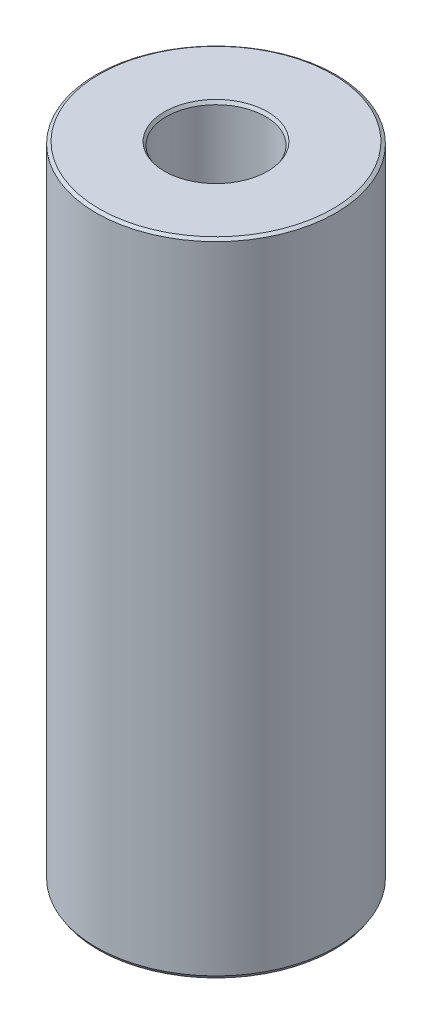
ISO-10303-21;
HEADER;
FILE_DESCRIPTION(('STEP AP214'),'2;1');
FILE_NAME('part.step','',(''),(''),'','','');
FILE_SCHEMA(('AUTOMOTIVE_DESIGN { 1 0 10303 214 1 1 1 1 }'));
ENDSEC;
DATA;
#1=APPLICATION_CONTEXT('core data for automotive mechanical design processes');
#2=APPLICATION_PROTOCOL_DEFINITION('international standard','automotive_design',2000,#1);
#3=PRODUCT_CONTEXT('',#1,'mechanical');
#4=PRODUCT('Part','Part','',(#3));
#5=PRODUCT_RELATED_PRODUCT_CATEGORY('part','',(#4));
#6=PRODUCT_DEFINITION_FORMATION('','',#4);
#7=PRODUCT_DEFINITION_CONTEXT('part definition',#1,'design');
#8=PRODUCT_DEFINITION('design','',#6,#7);
#9=PRODUCT_DEFINITION_SHAPE('','',#8);
#10=(LENGTH_UNIT() NAMED_UNIT(*) SI_UNIT(.MILLI.,.METRE.));
#11=(NAMED_UNIT(*) PLANE_ANGLE_UNIT() SI_UNIT($,.RADIAN.));
#12=(NAMED_UNIT(*) SI_UNIT($,.STERADIAN.) SOLID_ANGLE_UNIT());
#13=UNCERTAINTY_MEASURE_WITH_UNIT(LENGTH_MEASURE(1.E-05),#10,'distance_accuracy_value','');
#14=(GEOMETRIC_REPRESENTATION_CONTEXT(3) GLOBAL_UNCERTAINTY_ASSIGNED_CONTEXT((#13)) GLOBAL_UNIT_ASSIGNED_CONTEXT((#10,
#11,#12)) REPRESENTATION_CONTEXT('',''));
#15=CARTESIAN_POINT('',(0.,0.,0.));
#16=DIRECTION('',(0.,0.,1.));
#17=DIRECTION('',(1.,0.,0.));
#18=AXIS2_PLACEMENT_3D('',#15,#16,#17);
#19=CARTESIAN_POINT('',(0.,133.760016249652,0.));
#20=DIRECTION('',(0.,-1.,0.));
#21=DIRECTION('',(0.,0.,-1.));
#22=AXIS2_PLACEMENT_3D('',#19,#20,#21);
#23=CYLINDRICAL_SURFACE('',#22,25.);
#24=CARTESIAN_POINT('',(0.,0.658825721858519,0.));
#25=DIRECTION('',(0.,1.,0.));
#26=DIRECTION('',(0.,0.,1.));
#27=AXIS2_PLACEMENT_3D('',#24,#25,#26);
#28=CIRCLE('',#27,25.);
#29=CARTESIAN_POINT('',(0.,0.658825721858519,25.));
#30=VERTEX_POINT('',#29);
#31=EDGE_CURVE('E10',#30,#30,#28,.T.);
#32=ORIENTED_EDGE('',*,*,#31,.T.);
#33=EDGE_LOOP('',(#32));
#34=FACE_BOUND('',#33,.T.);
#35=CARTESIAN_POINT('',(0.,133.341393853596,0.));
#36=DIRECTION('',(0.,1.,0.));
#37=DIRECTION('',(0.,0.,1.));
#38=AXIS2_PLACEMENT_3D('',#35,#36,#37);
#39=CIRCLE('',#38,25.);
#40=CARTESIAN_POINT('',(0.,133.341393853596,25.));
#41=VERTEX_POINT('',#40);
#42=EDGE_CURVE('E50',#41,#41,#39,.F.);
#43=ORIENTED_EDGE('',*,*,#42,.T.);
#44=EDGE_LOOP('',(#43));
#45=FACE_BOUND('',#44,.T.);
#46=ADVANCED_FACE('F39',(#34,#45),#23,.T.);
#47=CARTESIAN_POINT('',(0.,133.760016249652,0.));
#48=DIRECTION('',(0.,1.,0.));
#49=DIRECTION('',(0.,0.,1.));
#50=AXIS2_PLACEMENT_3D('',#47,#48,#49);
#51=PLANE('',#50);
#52=CARTESIAN_POINT('',(0.,133.760016249652,0.));
#53=DIRECTION('',(0.,1.,0.));
#54=DIRECTION('',(0.,0.,1.));
#55=AXIS2_PLACEMENT_3D('',#52,#53,#54);
#56=CIRCLE('',#55,10.7630156165649);
#57=CARTESIAN_POINT('',(0.,133.760016249652,10.7630156165649));
#58=VERTEX_POINT('',#57);
#59=EDGE_CURVE('E58',#58,#58,#56,.F.);
#60=ORIENTED_EDGE('',*,*,#59,.T.);
#61=EDGE_LOOP('',(#60));
#62=FACE_BOUND('',#61,.T.);
#63=CARTESIAN_POINT('',(0.,133.760016249652,0.));
#64=DIRECTION('',(0.,1.,0.));
#65=DIRECTION('',(0.,0.,1.));
#66=AXIS2_PLACEMENT_3D('',#63,#64,#65);
#67=CIRCLE('',#66,24.3411742781414);
#68=CARTESIAN_POINT('',(0.,133.760016249652,24.3411742781414));
#69=VERTEX_POINT('',#68);
#70=EDGE_CURVE('E61',#69,#69,#67,.T.);
#71=ORIENTED_EDGE('',*,*,#70,.T.);
#72=EDGE_LOOP('',(#71));
#73=FACE_BOUND('',#72,.T.);
#74=ADVANCED_FACE('F88',(#62,#73),#51,.T.);
#75=CARTESIAN_POINT('',(0.,0.,0.));
#76=DIRECTION('',(0.,1.,0.));
#77=DIRECTION('',(0.,0.,1.));
#78=AXIS2_PLACEMENT_3D('',#75,#76,#77);
#79=PLANE('',#78);
#80=CARTESIAN_POINT('',(0.,0.,0.));
#81=DIRECTION('',(0.,1.,0.));
#82=DIRECTION('',(0.,0.,1.));
#83=AXIS2_PLACEMENT_3D('',#80,#81,#82);
#84=CIRCLE('',#83,11.0032189423683);
#85=CARTESIAN_POINT('',(0.,0.,11.0032189423683));
#86=VERTEX_POINT('',#85);
#87=EDGE_CURVE('E51',#86,#86,#84,.T.);
#88=ORIENTED_EDGE('',*,*,#87,.T.);
#89=EDGE_LOOP('',(#88));
#90=FACE_BOUND('',#89,.T.);
#91=CARTESIAN_POINT('',(0.,0.,0.));
#92=DIRECTION('',(0.,1.,0.));
#93=DIRECTION('',(0.,0.,1.));
#94=AXIS2_PLACEMENT_3D('',#91,#92,#93);
#95=CIRCLE('',#94,24.5813776039448);
#96=CARTESIAN_POINT('',(0.,0.,24.5813776039448));
#97=VERTEX_POINT('',#96);
#98=EDGE_CURVE('E54',#97,#97,#95,.F.);
#99=ORIENTED_EDGE('',*,*,#98,.T.);
#100=EDGE_LOOP('',(#99));
#101=FACE_BOUND('',#100,.T.);
#102=ADVANCED_FACE('F83',(#90,#101),#79,.F.);
#103=CARTESIAN_POINT('',(0.,133.760016249652,0.));
#104=DIRECTION('',(0.,-1.,0.));
#105=DIRECTION('',(0.,0.,-1.));
#106=AXIS2_PLACEMENT_3D('',#103,#104,#105);
#107=CYLINDRICAL_SURFACE('',#106,10.3443932205096);
#108=CARTESIAN_POINT('',(0.,133.101190527793,0.));
#109=DIRECTION('',(0.,1.,0.));
#110=DIRECTION('',(0.,0.,1.));
#111=AXIS2_PLACEMENT_3D('',#108,#109,#110);
#112=CIRCLE('',#111,10.3443932205096);
#113=CARTESIAN_POINT('',(0.,133.101190527793,10.3443932205096));
#114=VERTEX_POINT('',#113);
#115=EDGE_CURVE('E67',#114,#114,#112,.T.);
#116=ORIENTED_EDGE('',*,*,#115,.T.);
#117=EDGE_LOOP('',(#116));
#118=FACE_BOUND('',#117,.T.);
#119=CARTESIAN_POINT('',(0.,0.418622396055307,0.));
#120=DIRECTION('',(0.,1.,0.));
#121=DIRECTION('',(0.,0.,1.));
#122=AXIS2_PLACEMENT_3D('',#119,#120,#121);
#123=CIRCLE('',#122,10.3443932205096);
#124=CARTESIAN_POINT('',(0.,0.418622396055307,10.3443932205096));
#125=VERTEX_POINT('',#124);
#126=EDGE_CURVE('E69',#125,#125,#123,.F.);
#127=ORIENTED_EDGE('',*,*,#126,.T.);
#128=EDGE_LOOP('',(#127));
#129=FACE_BOUND('',#128,.T.);
#130=ADVANCED_FACE('F71',(#118,#129),#107,.F.);
#131=CARTESIAN_POINT('',(0.,133.101190527793,0.));
#132=DIRECTION('',(0.,1.,0.));
#133=DIRECTION('',(0.,0.,1.));
#134=AXIS2_PLACEMENT_3D('',#131,#132,#133);
#135=CONICAL_SURFACE('',#134,10.3443932205096,0.566047936619375);
#136=CARTESIAN_POINT('',(0.,133.760016249652,10.7630156165649));
#137=CARTESIAN_POINT('',(0.,133.753153481716,10.758654966606));
#138=CARTESIAN_POINT('',(0.,133.74629071378,10.7542943166471));
#139=CARTESIAN_POINT('',(0.,133.732565177907,10.7455730167293));
#140=CARTESIAN_POINT('',(0.,133.725702409971,10.7412123667703));
#141=CARTESIAN_POINT('',(0.,133.711976874099,10.7324910668525));
#142=CARTESIAN_POINT('',(0.,133.705114106163,10.7281304168936));
#143=CARTESIAN_POINT('',(0.,133.691388570291,10.7194091169758));
#144=CARTESIAN_POINT('',(0.,133.684525802355,10.7150484670169));
#145=CARTESIAN_POINT('',(0.,133.670800266483,10.7063271670991));
#146=CARTESIAN_POINT('',(0.,133.663937498547,10.7019665171402));
#147=CARTESIAN_POINT('',(0.,133.650211962675,10.6932452172223));
#148=CARTESIAN_POINT('',(0.,133.643349194739,10.6888845672634));
#149=CARTESIAN_POINT('',(0.,133.629623658867,10.6801632673456));
#150=CARTESIAN_POINT('',(0.,133.622760890931,10.6758026173867));
#151=CARTESIAN_POINT('',(0.,133.609035355059,10.6670813174689));
#152=CARTESIAN_POINT('',(0.,133.602172587123,10.66272066751));
#153=CARTESIAN_POINT('',(0.,133.588447051251,10.6539993675922));
#154=CARTESIAN_POINT('',(0.,133.581584283315,10.6496387176333));
#155=CARTESIAN_POINT('',(0.,133.567858747443,10.6409174177154));
#156=CARTESIAN_POINT('',(0.,133.560995979507,10.6365567677565));
#157=CARTESIAN_POINT('',(0.,133.547270443635,10.6278354678387));
#158=CARTESIAN_POINT('',(0.,133.540407675699,10.6234748178798));
#159=CARTESIAN_POINT('',(0.,133.526682139827,10.614753517962));
#160=CARTESIAN_POINT('',(0.,133.519819371891,10.6103928680031));
#161=CARTESIAN_POINT('',(0.,133.506093836019,10.6016715680853));
#162=CARTESIAN_POINT('',(0.,133.499231068083,10.5973109181264));
#163=CARTESIAN_POINT('',(0.,133.485505532211,10.5885896182085));
#164=CARTESIAN_POINT('',(0.,133.478642764274,10.5842289682496));
#165=CARTESIAN_POINT('',(0.,133.464917228402,10.5755076683318));
#166=CARTESIAN_POINT('',(0.,133.458054460466,10.5711470183729));
#167=CARTESIAN_POINT('',(0.,133.444328924594,10.5624257184551));
#168=CARTESIAN_POINT('',(0.,133.437466156658,10.5580650684962));
#169=CARTESIAN_POINT('',(0.,133.423740620786,10.5493437685784));
#170=CARTESIAN_POINT('',(0.,133.41687785285,10.5449831186194));
#171=CARTESIAN_POINT('',(0.,133.403152316978,10.5362618187016));
#172=CARTESIAN_POINT('',(0.,133.396289549042,10.5319011687427));
#173=CARTESIAN_POINT('',(0.,133.38256401317,10.5231798688249));
#174=CARTESIAN_POINT('',(0.,133.375701245234,10.518819218866));
#175=CARTESIAN_POINT('',(0.,133.361975709362,10.5100979189482));
#176=CARTESIAN_POINT('',(0.,133.355112941426,10.5057372689893));
#177=CARTESIAN_POINT('',(0.,133.341387405554,10.4970159690714));
#178=CARTESIAN_POINT('',(0.,133.334524637618,10.4926553191125));
#179=CARTESIAN_POINT('',(0.,133.320799101746,10.4839340191947));
#180=CARTESIAN_POINT('',(0.,133.31393633381,10.4795733692358));
#181=CARTESIAN_POINT('',(0.,133.300210797938,10.470852069318));
#182=CARTESIAN_POINT('',(0.,133.293348030002,10.4664914193591));
#183=CARTESIAN_POINT('',(0.,133.27962249413,10.4577701194413));
#184=CARTESIAN_POINT('',(0.,133.272759726194,10.4534094694824));
#185=CARTESIAN_POINT('',(0.,133.259034190322,10.4446881695645));
#186=CARTESIAN_POINT('',(0.,133.252171422386,10.4403275196056));
#187=CARTESIAN_POINT('',(0.,133.238445886514,10.4316062196878));
#188=CARTESIAN_POINT('',(0.,133.231583118578,10.4272455697289));
#189=CARTESIAN_POINT('',(0.,133.217857582705,10.4185242698111));
#190=CARTESIAN_POINT('',(0.,133.210994814769,10.4141636198522));
#191=CARTESIAN_POINT('',(0.,133.197269278897,10.4054423199344));
#192=CARTESIAN_POINT('',(0.,133.190406510961,10.4010816699755));
#193=CARTESIAN_POINT('',(0.,133.176680975089,10.3923603700576));
#194=CARTESIAN_POINT('',(0.,133.169818207153,10.3879997200987));
#195=CARTESIAN_POINT('',(0.,133.156092671281,10.3792784201809));
#196=CARTESIAN_POINT('',(0.,133.149229903345,10.374917770222));
#197=CARTESIAN_POINT('',(0.,133.135504367473,10.3661964703042));
#198=CARTESIAN_POINT('',(0.,133.128641599537,10.3618358203453));
#199=CARTESIAN_POINT('',(0.,133.114916063665,10.3531145204275));
#200=CARTESIAN_POINT('',(0.,133.108053295729,10.3487538704685));
#201=CARTESIAN_POINT('',(0.,133.101190527793,10.3443932205096));
#202=B_SPLINE_CURVE_WITH_KNOTS('',3,(#136,#137,#138,#139,#140,#141,#142,#143,#144,#145,#146,
#147,#148,#149,#150,#151,#152,#153,#154,#155,#156,#157,#158,#159,#160,#161,#162,#163,#164,#165,
#166,#167,#168,#169,#170,#171,#172,#173,#174,#175,#176,#177,#178,#179,#180,#181,#182,#183,#184,
#185,#186,#187,#188,#189,#190,#191,#192,#193,#194,#195,#196,#197,#198,#199,#200,#201),
.UNSPECIFIED.,.F.,.F.,(4,2,2,2,2,2,2,2,2,2,2,2,2,2,2,2,2,2,2,2,2,2,2,2,2,2,2,2,2,2,2,2,4),(0.,
0.0243929429604561,0.0487858859208879,0.0731788288813206,0.0975717718417524,0.121964714802185,
0.146357657762617,0.17075060072305,0.195143543683481,0.219536486643914,0.243929429604346,
0.268322372564778,0.29271531552521,0.317108258485643,0.341501201446075,0.365894144406507,
0.39028708736694,0.414680030327395,0.439072973287828,0.46346591624826,0.487858859208692,
0.512251802169124,0.536644745129557,0.561037688089989,0.585430631050421,0.609823574010853,
0.634216516971286,0.658609459931718,0.68300240289215,0.707395345852582,0.731788288813015,
0.756181231773447,0.780574174733879),.UNSPECIFIED.);
#203=EDGE_CURVE('BSEAM77',#58,#114,#202,.T.);
#204=ORIENTED_EDGE('',*,*,#59,.F.);
#205=ORIENTED_EDGE('',*,*,#115,.F.);
#206=ORIENTED_EDGE('',*,*,#203,.T.);
#207=ORIENTED_EDGE('',*,*,#203,.F.);
#208=EDGE_LOOP('',(#204,#206,#205,#207));
#209=FACE_BOUND('',#208,.T.);
#210=ADVANCED_FACE('F77',(#209),#135,.F.);
#211=CARTESIAN_POINT('',(0.,0.,0.));
#212=DIRECTION('',(0.,-1.,0.));
#213=DIRECTION('',(0.,0.,-1.));
#214=AXIS2_PLACEMENT_3D('',#211,#212,#213);
#215=CONICAL_SURFACE('',#214,11.0032189423683,1.00474839017551);
#216=ORIENTED_EDGE('',*,*,#126,.F.);
#217=EDGE_LOOP('',(#216));
#218=FACE_BOUND('',#217,.T.);
#219=ORIENTED_EDGE('',*,*,#87,.F.);
#220=EDGE_LOOP('',(#219));
#221=FACE_BOUND('',#220,.T.);
#222=ADVANCED_FACE('F73',(#218,#221),#215,.F.);
#223=CARTESIAN_POINT('',(0.,0.658825721858519,0.));
#224=DIRECTION('',(0.,1.,0.));
#225=DIRECTION('',(0.,0.,1.));
#226=AXIS2_PLACEMENT_3D('',#223,#224,#225);
#227=CONICAL_SURFACE('',#226,25.,0.566047936619389);
#228=ORIENTED_EDGE('',*,*,#98,.F.);
#229=EDGE_LOOP('',(#228));
#230=FACE_BOUND('',#229,.T.);
#231=ORIENTED_EDGE('',*,*,#31,.F.);
#232=EDGE_LOOP('',(#231));
#233=FACE_BOUND('',#232,.T.);
#234=ADVANCED_FACE('F76',(#230,#233),#227,.T.);
#235=CARTESIAN_POINT('',(0.,133.760016249652,0.));
#236=DIRECTION('',(0.,-1.,0.));
#237=DIRECTION('',(0.,0.,-1.));
#238=AXIS2_PLACEMENT_3D('',#235,#236,#237);
#239=CONICAL_SURFACE('',#238,24.3411742781414,1.00474839017553);
#240=ORIENTED_EDGE('',*,*,#42,.F.);
#241=EDGE_LOOP('',(#240));
#242=FACE_BOUND('',#241,.T.);
#243=ORIENTED_EDGE('',*,*,#70,.F.);
#244=EDGE_LOOP('',(#243));
#245=FACE_BOUND('',#244,.T.);
#246=ADVANCED_FACE('F45',(#242,#245),#239,.T.);
#247=CLOSED_SHELL('',(#46,#74,#102,#130,#210,#222,#234,#246));
#248=MANIFOLD_SOLID_BREP('B2',#247);
#249=ADVANCED_BREP_SHAPE_REPRESENTATION('',(#18,#248),#14);
#250=SHAPE_DEFINITION_REPRESENTATION(#9,#249);
ENDSEC;
END-ISO-10303-21;
